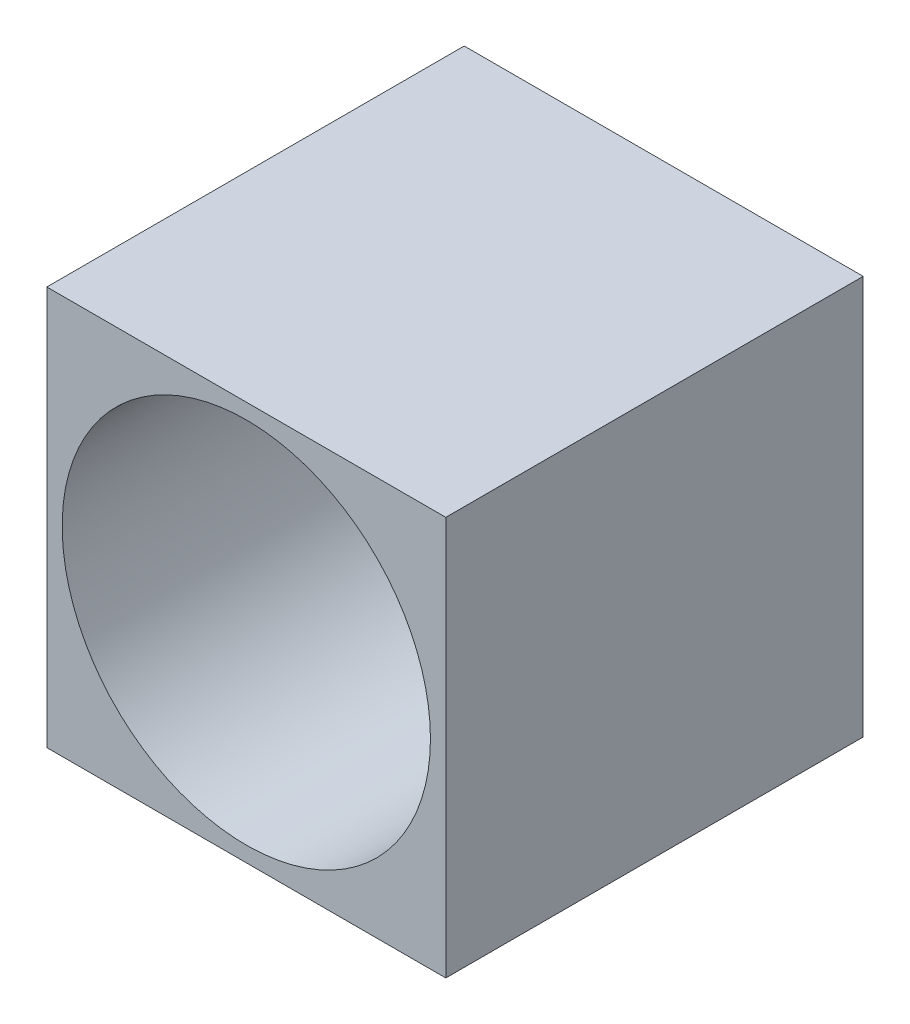
ISO-10303-21;
HEADER;
FILE_DESCRIPTION(('STEP AP214'),'2;1');
FILE_NAME('part.step','',(''),(''),'','','');
FILE_SCHEMA(('AUTOMOTIVE_DESIGN { 1 0 10303 214 1 1 1 1 }'));
ENDSEC;
DATA;
#1=APPLICATION_CONTEXT('core data for automotive mechanical design processes');
#2=APPLICATION_PROTOCOL_DEFINITION('international standard','automotive_design',2000,#1);
#3=PRODUCT_CONTEXT('',#1,'mechanical');
#4=PRODUCT('Part','Part','',(#3));
#5=PRODUCT_RELATED_PRODUCT_CATEGORY('part','',(#4));
#6=PRODUCT_DEFINITION_FORMATION('','',#4);
#7=PRODUCT_DEFINITION_CONTEXT('part definition',#1,'design');
#8=PRODUCT_DEFINITION('design','',#6,#7);
#9=PRODUCT_DEFINITION_SHAPE('','',#8);
#10=(LENGTH_UNIT() NAMED_UNIT(*) SI_UNIT(.MILLI.,.METRE.));
#11=(NAMED_UNIT(*) PLANE_ANGLE_UNIT() SI_UNIT($,.RADIAN.));
#12=(NAMED_UNIT(*) SI_UNIT($,.STERADIAN.) SOLID_ANGLE_UNIT());
#13=UNCERTAINTY_MEASURE_WITH_UNIT(LENGTH_MEASURE(1.E-05),#10,'distance_accuracy_value','');
#14=(GEOMETRIC_REPRESENTATION_CONTEXT(3) GLOBAL_UNCERTAINTY_ASSIGNED_CONTEXT((#13)) GLOBAL_UNIT_ASSIGNED_CONTEXT((#10,
#11,#12)) REPRESENTATION_CONTEXT('',''));
#15=CARTESIAN_POINT('',(0.,0.,0.));
#16=DIRECTION('',(0.,0.,1.));
#17=DIRECTION('',(1.,0.,0.));
#18=AXIS2_PLACEMENT_3D('',#15,#16,#17);
#19=CARTESIAN_POINT('',(-1.625,1.625,3.4));
#20=DIRECTION('',(0.,1.,0.));
#21=DIRECTION('',(0.,0.,1.));
#22=AXIS2_PLACEMENT_3D('',#19,#20,#21);
#23=PLANE('',#22);
#24=DIRECTION('',(1.,0.,0.));
#25=VECTOR('',#24,1.);
#26=CARTESIAN_POINT('',(-1.625,1.625,0.));
#27=LINE('',#26,#25);
#28=CARTESIAN_POINT('',(-1.625,1.625,0.));
#29=VERTEX_POINT('',#28);
#30=CARTESIAN_POINT('',(1.625,1.625,0.));
#31=VERTEX_POINT('',#30);
#32=EDGE_CURVE('E97',#29,#31,#27,.T.);
#33=ORIENTED_EDGE('',*,*,#32,.F.);
#34=DIRECTION('',(0.,0.,-1.));
#35=VECTOR('',#34,1.);
#36=CARTESIAN_POINT('',(-1.625,1.625,3.4));
#37=LINE('',#36,#35);
#38=CARTESIAN_POINT('',(-1.625,1.625,3.4));
#39=VERTEX_POINT('',#38);
#40=EDGE_CURVE('E11',#39,#29,#37,.T.);
#41=ORIENTED_EDGE('',*,*,#40,.F.);
#42=DIRECTION('',(1.,0.,0.));
#43=VECTOR('',#42,1.);
#44=CARTESIAN_POINT('',(-1.625,1.625,3.4));
#45=LINE('',#44,#43);
#46=CARTESIAN_POINT('',(1.625,1.625,3.4));
#47=VERTEX_POINT('',#46);
#48=EDGE_CURVE('E90',#39,#47,#45,.T.);
#49=ORIENTED_EDGE('',*,*,#48,.T.);
#50=DIRECTION('',(0.,0.,-1.));
#51=VECTOR('',#50,1.);
#52=CARTESIAN_POINT('',(1.625,1.625,3.4));
#53=LINE('',#52,#51);
#54=EDGE_CURVE('E35',#47,#31,#53,.T.);
#55=ORIENTED_EDGE('',*,*,#54,.T.);
#56=EDGE_LOOP('',(#33,#41,#49,#55));
#57=FACE_BOUND('',#56,.T.);
#58=ADVANCED_FACE('F32',(#57),#23,.T.);
#59=CARTESIAN_POINT('',(-1.625,-1.625,3.4));
#60=DIRECTION('',(-1.,0.,0.));
#61=DIRECTION('',(0.,0.,1.));
#62=AXIS2_PLACEMENT_3D('',#59,#60,#61);
#63=PLANE('',#62);
#64=DIRECTION('',(0.,1.,0.));
#65=VECTOR('',#64,1.);
#66=CARTESIAN_POINT('',(-1.625,-1.625,0.));
#67=LINE('',#66,#65);
#68=CARTESIAN_POINT('',(-1.625,-1.625,0.));
#69=VERTEX_POINT('',#68);
#70=EDGE_CURVE('E92',#69,#29,#67,.T.);
#71=ORIENTED_EDGE('',*,*,#70,.F.);
#72=DIRECTION('',(0.,0.,-1.));
#73=VECTOR('',#72,1.);
#74=CARTESIAN_POINT('',(-1.625,-1.625,3.4));
#75=LINE('',#74,#73);
#76=CARTESIAN_POINT('',(-1.625,-1.625,3.4));
#77=VERTEX_POINT('',#76);
#78=EDGE_CURVE('E41',#77,#69,#75,.T.);
#79=ORIENTED_EDGE('',*,*,#78,.F.);
#80=DIRECTION('',(0.,1.,0.));
#81=VECTOR('',#80,1.);
#82=CARTESIAN_POINT('',(-1.625,-1.625,3.4));
#83=LINE('',#82,#81);
#84=EDGE_CURVE('E87',#77,#39,#83,.T.);
#85=ORIENTED_EDGE('',*,*,#84,.T.);
#86=ORIENTED_EDGE('',*,*,#40,.T.);
#87=EDGE_LOOP('',(#71,#79,#85,#86));
#88=FACE_BOUND('',#87,.T.);
#89=ADVANCED_FACE('F108',(#88),#63,.T.);
#90=CARTESIAN_POINT('',(1.625,-1.625,3.4));
#91=DIRECTION('',(0.,-1.,0.));
#92=DIRECTION('',(0.,0.,-1.));
#93=AXIS2_PLACEMENT_3D('',#90,#91,#92);
#94=PLANE('',#93);
#95=DIRECTION('',(-1.,0.,0.));
#96=VECTOR('',#95,1.);
#97=CARTESIAN_POINT('',(1.625,-1.625,0.));
#98=LINE('',#97,#96);
#99=CARTESIAN_POINT('',(1.625,-1.625,0.));
#100=VERTEX_POINT('',#99);
#101=EDGE_CURVE('E82',#100,#69,#98,.T.);
#102=ORIENTED_EDGE('',*,*,#101,.F.);
#103=DIRECTION('',(0.,0.,-1.));
#104=VECTOR('',#103,1.);
#105=CARTESIAN_POINT('',(1.625,-1.625,3.4));
#106=LINE('',#105,#104);
#107=CARTESIAN_POINT('',(1.625,-1.625,3.4));
#108=VERTEX_POINT('',#107);
#109=EDGE_CURVE('E77',#108,#100,#106,.T.);
#110=ORIENTED_EDGE('',*,*,#109,.F.);
#111=DIRECTION('',(-1.,0.,0.));
#112=VECTOR('',#111,1.);
#113=CARTESIAN_POINT('',(1.625,-1.625,3.4));
#114=LINE('',#113,#112);
#115=EDGE_CURVE('E80',#108,#77,#114,.T.);
#116=ORIENTED_EDGE('',*,*,#115,.T.);
#117=ORIENTED_EDGE('',*,*,#78,.T.);
#118=EDGE_LOOP('',(#102,#110,#116,#117));
#119=FACE_BOUND('',#118,.T.);
#120=ADVANCED_FACE('F79',(#119),#94,.T.);
#121=CARTESIAN_POINT('',(1.625,1.625,3.4));
#122=DIRECTION('',(1.,0.,0.));
#123=DIRECTION('',(0.,0.,-1.));
#124=AXIS2_PLACEMENT_3D('',#121,#122,#123);
#125=PLANE('',#124);
#126=DIRECTION('',(0.,-1.,0.));
#127=VECTOR('',#126,1.);
#128=CARTESIAN_POINT('',(1.625,1.625,0.));
#129=LINE('',#128,#127);
#130=EDGE_CURVE('E100',#31,#100,#129,.T.);
#131=ORIENTED_EDGE('',*,*,#130,.F.);
#132=ORIENTED_EDGE('',*,*,#54,.F.);
#133=DIRECTION('',(0.,-1.,0.));
#134=VECTOR('',#133,1.);
#135=CARTESIAN_POINT('',(1.625,1.625,3.4));
#136=LINE('',#135,#134);
#137=EDGE_CURVE('E86',#47,#108,#136,.T.);
#138=ORIENTED_EDGE('',*,*,#137,.T.);
#139=ORIENTED_EDGE('',*,*,#109,.T.);
#140=EDGE_LOOP('',(#131,#132,#138,#139));
#141=FACE_BOUND('',#140,.T.);
#142=ADVANCED_FACE('F89',(#141),#125,.T.);
#143=CARTESIAN_POINT('',(0.,0.,3.4));
#144=DIRECTION('',(0.,0.,-1.));
#145=DIRECTION('',(-1.,0.,0.));
#146=AXIS2_PLACEMENT_3D('',#143,#144,#145);
#147=PLANE('',#146);
#148=CARTESIAN_POINT('',(0.,0.,3.4));
#149=DIRECTION('',(0.,0.,-1.));
#150=DIRECTION('',(1.,0.,0.));
#151=AXIS2_PLACEMENT_3D('',#148,#149,#150);
#152=CIRCLE('',#151,1.5);
#153=CARTESIAN_POINT('',(1.5,0.,3.4));
#154=VERTEX_POINT('',#153);
#155=EDGE_CURVE('E101',#154,#154,#152,.T.);
#156=ORIENTED_EDGE('',*,*,#155,.T.);
#157=EDGE_LOOP('',(#156));
#158=FACE_BOUND('',#157,.T.);
#159=ORIENTED_EDGE('',*,*,#48,.F.);
#160=ORIENTED_EDGE('',*,*,#84,.F.);
#161=ORIENTED_EDGE('',*,*,#115,.F.);
#162=ORIENTED_EDGE('',*,*,#137,.F.);
#163=EDGE_LOOP('',(#159,#160,#161,#162));
#164=FACE_BOUND('',#163,.T.);
#165=ADVANCED_FACE('F85',(#158,#164),#147,.F.);
#166=CARTESIAN_POINT('',(0.,0.,0.));
#167=DIRECTION('',(0.,0.,-1.));
#168=DIRECTION('',(-1.,0.,0.));
#169=AXIS2_PLACEMENT_3D('',#166,#167,#168);
#170=PLANE('',#169);
#171=CARTESIAN_POINT('',(0.,0.,0.));
#172=DIRECTION('',(0.,0.,-1.));
#173=DIRECTION('',(1.,0.,0.));
#174=AXIS2_PLACEMENT_3D('',#171,#172,#173);
#175=CIRCLE('',#174,1.5);
#176=CARTESIAN_POINT('',(1.5,0.,0.));
#177=VERTEX_POINT('',#176);
#178=EDGE_CURVE('E138',#177,#177,#175,.T.);
#179=ORIENTED_EDGE('',*,*,#178,.F.);
#180=EDGE_LOOP('',(#179));
#181=FACE_BOUND('',#180,.T.);
#182=ORIENTED_EDGE('',*,*,#32,.T.);
#183=ORIENTED_EDGE('',*,*,#130,.T.);
#184=ORIENTED_EDGE('',*,*,#101,.T.);
#185=ORIENTED_EDGE('',*,*,#70,.T.);
#186=EDGE_LOOP('',(#182,#183,#184,#185));
#187=FACE_BOUND('',#186,.T.);
#188=ADVANCED_FACE('F107',(#181,#187),#170,.T.);
#189=CARTESIAN_POINT('',(0.,0.,3.4));
#190=DIRECTION('',(0.,0.,-1.));
#191=DIRECTION('',(-1.,0.,0.));
#192=AXIS2_PLACEMENT_3D('',#189,#190,#191);
#193=CYLINDRICAL_SURFACE('',#192,1.5);
#194=ORIENTED_EDGE('',*,*,#155,.F.);
#195=EDGE_LOOP('',(#194));
#196=FACE_BOUND('',#195,.T.);
#197=ORIENTED_EDGE('',*,*,#178,.T.);
#198=EDGE_LOOP('',(#197));
#199=FACE_BOUND('',#198,.T.);
#200=ADVANCED_FACE('F126',(#196,#199),#193,.F.);
#201=CLOSED_SHELL('',(#58,#89,#120,#142,#165,#188,#200));
#202=MANIFOLD_SOLID_BREP('B2',#201);
#203=ADVANCED_BREP_SHAPE_REPRESENTATION('',(#18,#202),#14);
#204=SHAPE_DEFINITION_REPRESENTATION(#9,#203);
ENDSEC;
END-ISO-10303-21;
